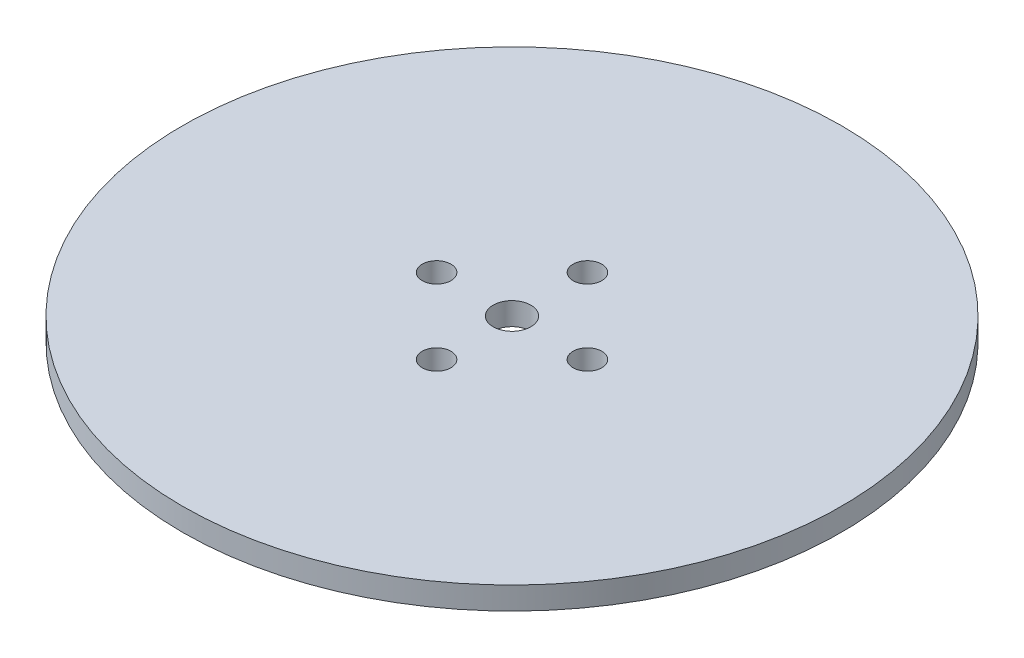
ISO-10303-21;
HEADER;
FILE_DESCRIPTION(('STEP AP214'),'2;1');
FILE_NAME('part.step','',(''),(''),'','','');
FILE_SCHEMA(('AUTOMOTIVE_DESIGN { 1 0 10303 214 1 1 1 1 }'));
ENDSEC;
DATA;
#1=APPLICATION_CONTEXT('core data for automotive mechanical design processes');
#2=APPLICATION_PROTOCOL_DEFINITION('international standard','automotive_design',2000,#1);
#3=PRODUCT_CONTEXT('',#1,'mechanical');
#4=PRODUCT('Part','Part','',(#3));
#5=PRODUCT_RELATED_PRODUCT_CATEGORY('part','',(#4));
#6=PRODUCT_DEFINITION_FORMATION('','',#4);
#7=PRODUCT_DEFINITION_CONTEXT('part definition',#1,'design');
#8=PRODUCT_DEFINITION('design','',#6,#7);
#9=PRODUCT_DEFINITION_SHAPE('','',#8);
#10=(LENGTH_UNIT() NAMED_UNIT(*) SI_UNIT(.MILLI.,.METRE.));
#11=(NAMED_UNIT(*) PLANE_ANGLE_UNIT() SI_UNIT($,.RADIAN.));
#12=(NAMED_UNIT(*) SI_UNIT($,.STERADIAN.) SOLID_ANGLE_UNIT());
#13=UNCERTAINTY_MEASURE_WITH_UNIT(LENGTH_MEASURE(1.E-05),#10,'distance_accuracy_value','');
#14=(GEOMETRIC_REPRESENTATION_CONTEXT(3) GLOBAL_UNCERTAINTY_ASSIGNED_CONTEXT((#13)) GLOBAL_UNIT_ASSIGNED_CONTEXT((#10,
#11,#12)) REPRESENTATION_CONTEXT('',''));
#15=CARTESIAN_POINT('',(0.,0.,0.));
#16=DIRECTION('',(0.,0.,1.));
#17=DIRECTION('',(1.,0.,0.));
#18=AXIS2_PLACEMENT_3D('',#15,#16,#17);
#19=CARTESIAN_POINT('',(0.,6.,0.));
#20=DIRECTION('',(0.,-1.,0.));
#21=DIRECTION('',(0.,0.,-1.));
#22=AXIS2_PLACEMENT_3D('',#19,#20,#21);
#23=CYLINDRICAL_SURFACE('',#22,87.5);
#24=CARTESIAN_POINT('',(0.,6.,0.));
#25=DIRECTION('',(0.,1.,0.));
#26=DIRECTION('',(0.,0.,1.));
#27=AXIS2_PLACEMENT_3D('',#24,#25,#26);
#28=CIRCLE('',#27,87.5);
#29=CARTESIAN_POINT('',(0.,6.,87.5));
#30=VERTEX_POINT('',#29);
#31=EDGE_CURVE('E10',#30,#30,#28,.T.);
#32=ORIENTED_EDGE('',*,*,#31,.F.);
#33=EDGE_LOOP('',(#32));
#34=FACE_BOUND('',#33,.T.);
#35=CARTESIAN_POINT('',(0.,0.,0.));
#36=DIRECTION('',(0.,1.,0.));
#37=DIRECTION('',(0.,0.,1.));
#38=AXIS2_PLACEMENT_3D('',#35,#36,#37);
#39=CIRCLE('',#38,87.5);
#40=CARTESIAN_POINT('',(0.,0.,87.5));
#41=VERTEX_POINT('',#40);
#42=EDGE_CURVE('E37',#41,#41,#39,.T.);
#43=ORIENTED_EDGE('',*,*,#42,.T.);
#44=EDGE_LOOP('',(#43));
#45=FACE_BOUND('',#44,.T.);
#46=ADVANCED_FACE('F40',(#34,#45),#23,.T.);
#47=CARTESIAN_POINT('',(0.,6.,0.));
#48=DIRECTION('',(0.,1.,0.));
#49=DIRECTION('',(0.,0.,1.));
#50=AXIS2_PLACEMENT_3D('',#47,#48,#49);
#51=PLANE('',#50);
#52=CARTESIAN_POINT('',(0.,6.,20.0292417393292));
#53=DIRECTION('',(0.,1.,0.));
#54=DIRECTION('',(1.,0.,0.));
#55=AXIS2_PLACEMENT_3D('',#52,#53,#54);
#56=CIRCLE('',#55,3.81403995847144);
#57=CARTESIAN_POINT('',(3.81403995847151,6.,20.0292417393292));
#58=VERTEX_POINT('',#57);
#59=EDGE_CURVE('E71',#58,#58,#56,.T.);
#60=ORIENTED_EDGE('',*,*,#59,.F.);
#61=EDGE_LOOP('',(#60));
#62=FACE_BOUND('',#61,.T.);
#63=CARTESIAN_POINT('',(20.0292417393292,6.,0.));
#64=DIRECTION('',(0.,1.,0.));
#65=DIRECTION('',(0.,0.,-1.));
#66=AXIS2_PLACEMENT_3D('',#63,#64,#65);
#67=CIRCLE('',#66,3.81403995847144);
#68=CARTESIAN_POINT('',(20.0292417393292,6.,-3.81403995847144));
#69=VERTEX_POINT('',#68);
#70=EDGE_CURVE('E70',#69,#69,#67,.T.);
#71=ORIENTED_EDGE('',*,*,#70,.F.);
#72=EDGE_LOOP('',(#71));
#73=FACE_BOUND('',#72,.T.);
#74=CARTESIAN_POINT('',(-2.09795171292137E-13,6.,-20.0292417393292));
#75=DIRECTION('',(0.,1.,0.));
#76=DIRECTION('',(-1.,0.,0.));
#77=AXIS2_PLACEMENT_3D('',#74,#75,#76);
#78=CIRCLE('',#77,3.81403995847144);
#79=CARTESIAN_POINT('',(-3.81403995847165,6.,-20.0292417393291));
#80=VERTEX_POINT('',#79);
#81=EDGE_CURVE('E61',#80,#80,#78,.T.);
#82=ORIENTED_EDGE('',*,*,#81,.F.);
#83=EDGE_LOOP('',(#82));
#84=FACE_BOUND('',#83,.T.);
#85=CARTESIAN_POINT('',(-20.0292417393292,6.,0.));
#86=DIRECTION('',(0.,1.,0.));
#87=DIRECTION('',(0.,0.,1.));
#88=AXIS2_PLACEMENT_3D('',#85,#86,#87);
#89=CIRCLE('',#88,3.81403995847144);
#90=CARTESIAN_POINT('',(-20.0292417393292,6.,3.81403995847144));
#91=VERTEX_POINT('',#90);
#92=EDGE_CURVE('E54',#91,#91,#89,.T.);
#93=ORIENTED_EDGE('',*,*,#92,.F.);
#94=EDGE_LOOP('',(#93));
#95=FACE_BOUND('',#94,.T.);
#96=CARTESIAN_POINT('',(0.,6.,0.));
#97=DIRECTION('',(0.,1.,0.));
#98=DIRECTION('',(0.,0.,1.));
#99=AXIS2_PLACEMENT_3D('',#96,#97,#98);
#100=CIRCLE('',#99,5.);
#101=CARTESIAN_POINT('',(0.,6.,5.));
#102=VERTEX_POINT('',#101);
#103=EDGE_CURVE('E50',#102,#102,#100,.T.);
#104=ORIENTED_EDGE('',*,*,#103,.F.);
#105=EDGE_LOOP('',(#104));
#106=FACE_BOUND('',#105,.T.);
#107=ORIENTED_EDGE('',*,*,#31,.T.);
#108=EDGE_LOOP('',(#107));
#109=FACE_BOUND('',#108,.T.);
#110=ADVANCED_FACE('F86',(#62,#73,#84,#95,#106,#109),#51,.T.);
#111=CARTESIAN_POINT('',(0.,0.,0.));
#112=DIRECTION('',(0.,1.,0.));
#113=DIRECTION('',(0.,0.,1.));
#114=AXIS2_PLACEMENT_3D('',#111,#112,#113);
#115=PLANE('',#114);
#116=CARTESIAN_POINT('',(0.,0.,0.));
#117=DIRECTION('',(0.,1.,0.));
#118=DIRECTION('',(0.,0.,1.));
#119=AXIS2_PLACEMENT_3D('',#116,#117,#118);
#120=CIRCLE('',#119,5.);
#121=CARTESIAN_POINT('',(0.,0.,5.));
#122=VERTEX_POINT('',#121);
#123=EDGE_CURVE('E47',#122,#122,#120,.T.);
#124=ORIENTED_EDGE('',*,*,#123,.T.);
#125=EDGE_LOOP('',(#124));
#126=FACE_BOUND('',#125,.T.);
#127=ORIENTED_EDGE('',*,*,#42,.F.);
#128=EDGE_LOOP('',(#127));
#129=FACE_BOUND('',#128,.T.);
#130=ADVANCED_FACE('F93',(#126,#129),#115,.F.);
#131=CARTESIAN_POINT('',(0.,6.,0.));
#132=DIRECTION('',(0.,-1.,0.));
#133=DIRECTION('',(0.,0.,-1.));
#134=AXIS2_PLACEMENT_3D('',#131,#132,#133);
#135=CYLINDRICAL_SURFACE('',#134,5.);
#136=ORIENTED_EDGE('',*,*,#103,.T.);
#137=EDGE_LOOP('',(#136));
#138=FACE_BOUND('',#137,.T.);
#139=ORIENTED_EDGE('',*,*,#123,.F.);
#140=EDGE_LOOP('',(#139));
#141=FACE_BOUND('',#140,.T.);
#142=ADVANCED_FACE('F101',(#138,#141),#135,.F.);
#143=CARTESIAN_POINT('',(-20.0292417393292,0.321859018999577,0.));
#144=DIRECTION('',(0.,1.,0.));
#145=DIRECTION('',(0.,0.,1.));
#146=AXIS2_PLACEMENT_3D('',#143,#144,#145);
#147=CYLINDRICAL_SURFACE('',#146,3.81403995847144);
#148=CARTESIAN_POINT('',(-20.0292417393292,0.321859018999577,0.));
#149=DIRECTION('',(0.,1.,0.));
#150=DIRECTION('',(0.,0.,1.));
#151=AXIS2_PLACEMENT_3D('',#148,#149,#150);
#152=CIRCLE('',#151,3.81403995847144);
#153=CARTESIAN_POINT('',(-20.0292417393292,0.321859018999577,3.81403995847144));
#154=VERTEX_POINT('',#153);
#155=EDGE_CURVE('E55',#154,#154,#152,.T.);
#156=ORIENTED_EDGE('',*,*,#155,.F.);
#157=EDGE_LOOP('',(#156));
#158=FACE_BOUND('',#157,.T.);
#159=ORIENTED_EDGE('',*,*,#92,.T.);
#160=EDGE_LOOP('',(#159));
#161=FACE_BOUND('',#160,.T.);
#162=ADVANCED_FACE('F102',(#158,#161),#147,.F.);
#163=CARTESIAN_POINT('',(-20.0292417393292,0.321859018999577,0.));
#164=DIRECTION('',(0.,1.,0.));
#165=DIRECTION('',(0.,0.,1.));
#166=AXIS2_PLACEMENT_3D('',#163,#164,#165);
#167=PLANE('',#166);
#168=ORIENTED_EDGE('',*,*,#155,.T.);
#169=EDGE_LOOP('',(#168));
#170=FACE_BOUND('',#169,.T.);
#171=ADVANCED_FACE('F133',(#170),#167,.T.);
#172=CARTESIAN_POINT('',(-2.09795171292137E-13,0.321859018999577,-20.0292417393292));
#173=DIRECTION('',(0.,1.,0.));
#174=DIRECTION('',(0.,0.,1.));
#175=AXIS2_PLACEMENT_3D('',#172,#173,#174);
#176=CYLINDRICAL_SURFACE('',#175,3.81403995847144);
#177=CARTESIAN_POINT('',(-2.09795171292137E-13,0.321859018999577,-20.0292417393292));
#178=DIRECTION('',(0.,1.,0.));
#179=DIRECTION('',(-1.,0.,0.));
#180=AXIS2_PLACEMENT_3D('',#177,#178,#179);
#181=CIRCLE('',#180,3.81403995847144);
#182=CARTESIAN_POINT('',(-3.81403995847165,0.321859018999577,-20.0292417393291));
#183=VERTEX_POINT('',#182);
#184=EDGE_CURVE('E63',#183,#183,#181,.T.);
#185=ORIENTED_EDGE('',*,*,#184,.F.);
#186=EDGE_LOOP('',(#185));
#187=FACE_BOUND('',#186,.T.);
#188=ORIENTED_EDGE('',*,*,#81,.T.);
#189=EDGE_LOOP('',(#188));
#190=FACE_BOUND('',#189,.T.);
#191=ADVANCED_FACE('F142',(#187,#190),#176,.F.);
#192=CARTESIAN_POINT('',(-2.09795171292137E-13,0.321859018999577,-20.0292417393292));
#193=DIRECTION('',(0.,1.,0.));
#194=DIRECTION('',(-1.,0.,0.));
#195=AXIS2_PLACEMENT_3D('',#192,#193,#194);
#196=PLANE('',#195);
#197=ORIENTED_EDGE('',*,*,#184,.T.);
#198=EDGE_LOOP('',(#197));
#199=FACE_BOUND('',#198,.T.);
#200=ADVANCED_FACE('F156',(#199),#196,.T.);
#201=CARTESIAN_POINT('',(20.0292417393292,0.321859018999577,0.));
#202=DIRECTION('',(0.,1.,0.));
#203=DIRECTION('',(0.,0.,1.));
#204=AXIS2_PLACEMENT_3D('',#201,#202,#203);
#205=CYLINDRICAL_SURFACE('',#204,3.81403995847144);
#206=CARTESIAN_POINT('',(20.0292417393292,0.321859018999577,0.));
#207=DIRECTION('',(0.,1.,0.));
#208=DIRECTION('',(0.,0.,-1.));
#209=AXIS2_PLACEMENT_3D('',#206,#207,#208);
#210=CIRCLE('',#209,3.81403995847144);
#211=CARTESIAN_POINT('',(20.0292417393292,0.321859018999577,-3.81403995847144));
#212=VERTEX_POINT('',#211);
#213=EDGE_CURVE('E69',#212,#212,#210,.T.);
#214=ORIENTED_EDGE('',*,*,#213,.F.);
#215=EDGE_LOOP('',(#214));
#216=FACE_BOUND('',#215,.T.);
#217=ORIENTED_EDGE('',*,*,#70,.T.);
#218=EDGE_LOOP('',(#217));
#219=FACE_BOUND('',#218,.T.);
#220=ADVANCED_FACE('F164',(#216,#219),#205,.F.);
#221=CARTESIAN_POINT('',(20.0292417393292,0.321859018999577,0.));
#222=DIRECTION('',(0.,1.,0.));
#223=DIRECTION('',(0.,0.,-1.));
#224=AXIS2_PLACEMENT_3D('',#221,#222,#223);
#225=PLANE('',#224);
#226=ORIENTED_EDGE('',*,*,#213,.T.);
#227=EDGE_LOOP('',(#226));
#228=FACE_BOUND('',#227,.T.);
#229=ADVANCED_FACE('F83',(#228),#225,.T.);
#230=CARTESIAN_POINT('',(0.,0.321859018999577,20.0292417393292));
#231=DIRECTION('',(0.,1.,0.));
#232=DIRECTION('',(0.,0.,1.));
#233=AXIS2_PLACEMENT_3D('',#230,#231,#232);
#234=CYLINDRICAL_SURFACE('',#233,3.81403995847144);
#235=CARTESIAN_POINT('',(0.,0.321859018999577,20.0292417393292));
#236=DIRECTION('',(0.,1.,0.));
#237=DIRECTION('',(1.,0.,0.));
#238=AXIS2_PLACEMENT_3D('',#235,#236,#237);
#239=CIRCLE('',#238,3.81403995847144);
#240=CARTESIAN_POINT('',(3.81403995847151,0.321859018999577,20.0292417393292));
#241=VERTEX_POINT('',#240);
#242=EDGE_CURVE('E59',#241,#241,#239,.T.);
#243=ORIENTED_EDGE('',*,*,#242,.F.);
#244=EDGE_LOOP('',(#243));
#245=FACE_BOUND('',#244,.T.);
#246=ORIENTED_EDGE('',*,*,#59,.T.);
#247=EDGE_LOOP('',(#246));
#248=FACE_BOUND('',#247,.T.);
#249=ADVANCED_FACE('F81',(#245,#248),#234,.F.);
#250=CARTESIAN_POINT('',(0.,0.321859018999577,20.0292417393292));
#251=DIRECTION('',(0.,1.,0.));
#252=DIRECTION('',(1.,0.,0.));
#253=AXIS2_PLACEMENT_3D('',#250,#251,#252);
#254=PLANE('',#253);
#255=ORIENTED_EDGE('',*,*,#242,.T.);
#256=EDGE_LOOP('',(#255));
#257=FACE_BOUND('',#256,.T.);
#258=ADVANCED_FACE('F78',(#257),#254,.T.);
#259=CLOSED_SHELL('',(#46,#110,#130,#142,#162,#171,#191,#200,#220,#229,#249,#258));
#260=MANIFOLD_SOLID_BREP('B2',#259);
#261=ADVANCED_BREP_SHAPE_REPRESENTATION('',(#18,#260),#14);
#262=SHAPE_DEFINITION_REPRESENTATION(#9,#261);
ENDSEC;
END-ISO-10303-21;
